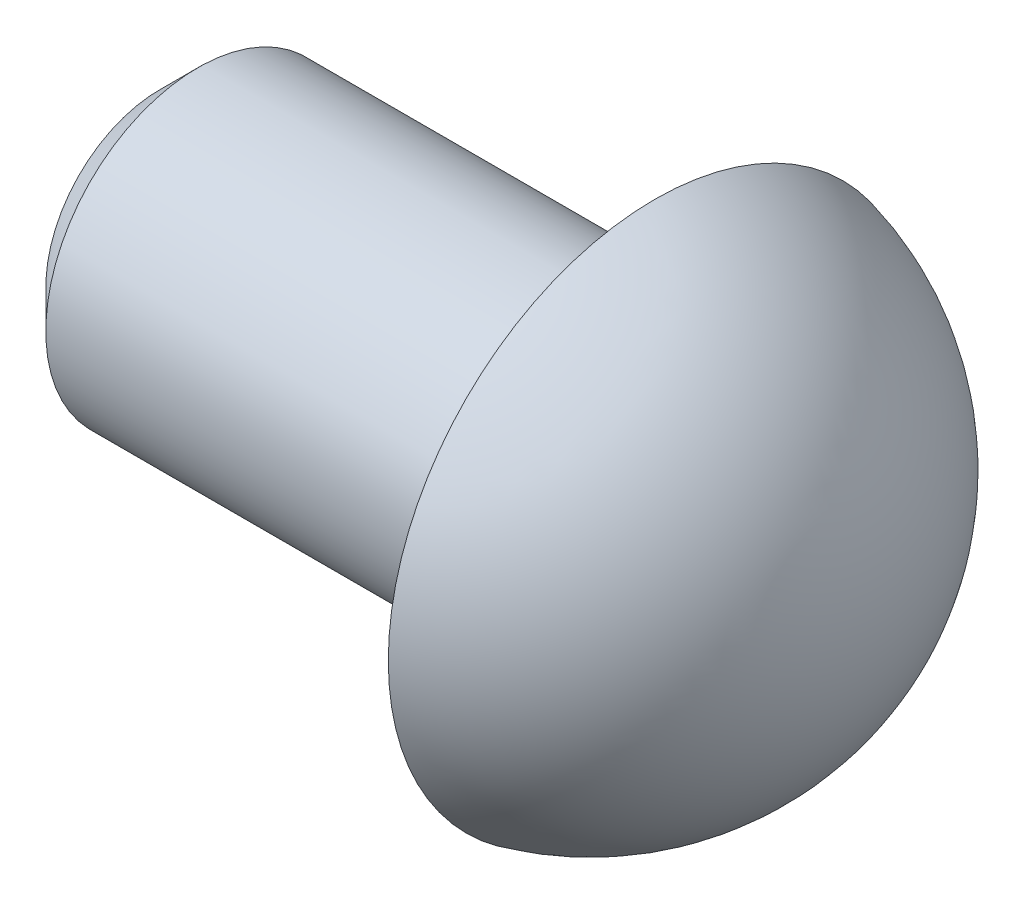
ISO-10303-21;
HEADER;
FILE_DESCRIPTION(('STEP AP214'),'2;1');
FILE_NAME('part.step','',(''),(''),'','','');
FILE_SCHEMA(('AUTOMOTIVE_DESIGN { 1 0 10303 214 1 1 1 1 }'));
ENDSEC;
DATA;
#1=APPLICATION_CONTEXT('core data for automotive mechanical design processes');
#2=APPLICATION_PROTOCOL_DEFINITION('international standard','automotive_design',2000,#1);
#3=PRODUCT_CONTEXT('',#1,'mechanical');
#4=PRODUCT('Part','Part','',(#3));
#5=PRODUCT_RELATED_PRODUCT_CATEGORY('part','',(#4));
#6=PRODUCT_DEFINITION_FORMATION('','',#4);
#7=PRODUCT_DEFINITION_CONTEXT('part definition',#1,'design');
#8=PRODUCT_DEFINITION('design','',#6,#7);
#9=PRODUCT_DEFINITION_SHAPE('','',#8);
#10=(LENGTH_UNIT() NAMED_UNIT(*) SI_UNIT(.MILLI.,.METRE.));
#11=(NAMED_UNIT(*) PLANE_ANGLE_UNIT() SI_UNIT($,.RADIAN.));
#12=(NAMED_UNIT(*) SI_UNIT($,.STERADIAN.) SOLID_ANGLE_UNIT());
#13=UNCERTAINTY_MEASURE_WITH_UNIT(LENGTH_MEASURE(1.E-05),#10,'distance_accuracy_value','');
#14=(GEOMETRIC_REPRESENTATION_CONTEXT(3) GLOBAL_UNCERTAINTY_ASSIGNED_CONTEXT((#13)) GLOBAL_UNIT_ASSIGNED_CONTEXT((#10,
#11,#12)) REPRESENTATION_CONTEXT('',''));
#15=CARTESIAN_POINT('',(0.,0.,0.));
#16=DIRECTION('',(0.,0.,1.));
#17=DIRECTION('',(1.,0.,0.));
#18=AXIS2_PLACEMENT_3D('',#15,#16,#17);
#19=CARTESIAN_POINT('',(-6.5,0.,0.));
#20=DIRECTION('',(1.,0.,0.));
#21=DIRECTION('',(0.,0.,-1.));
#22=AXIS2_PLACEMENT_3D('',#19,#20,#21);
#23=CYLINDRICAL_SURFACE('',#22,2.);
#24=CARTESIAN_POINT('',(-6.,0.,0.));
#25=DIRECTION('',(1.,0.,0.));
#26=DIRECTION('',(0.,0.,-1.));
#27=AXIS2_PLACEMENT_3D('',#24,#25,#26);
#28=CIRCLE('',#27,2.);
#29=CARTESIAN_POINT('',(-6.,0.,-2.));
#30=VERTEX_POINT('',#29);
#31=EDGE_CURVE('E45',#30,#30,#28,.T.);
#32=ORIENTED_EDGE('',*,*,#31,.T.);
#33=EDGE_LOOP('',(#32));
#34=FACE_BOUND('',#33,.T.);
#35=CARTESIAN_POINT('',(0.,0.,0.));
#36=DIRECTION('',(1.,0.,0.));
#37=DIRECTION('',(0.,0.,-1.));
#38=AXIS2_PLACEMENT_3D('',#35,#36,#37);
#39=CIRCLE('',#38,2.);
#40=CARTESIAN_POINT('',(0.,0.,-2.));
#41=VERTEX_POINT('',#40);
#42=EDGE_CURVE('E50',#41,#41,#39,.T.);
#43=ORIENTED_EDGE('',*,*,#42,.F.);
#44=EDGE_LOOP('',(#43));
#45=FACE_BOUND('',#44,.T.);
#46=ADVANCED_FACE('F37',(#34,#45),#23,.T.);
#47=CARTESIAN_POINT('',(-6.5,0.,0.));
#48=DIRECTION('',(1.,0.,0.));
#49=DIRECTION('',(0.,0.,-1.));
#50=AXIS2_PLACEMENT_3D('',#47,#48,#49);
#51=PLANE('',#50);
#52=CARTESIAN_POINT('',(-6.5,0.,0.));
#53=DIRECTION('',(1.,0.,0.));
#54=DIRECTION('',(0.,0.,-1.));
#55=AXIS2_PLACEMENT_3D('',#52,#53,#54);
#56=CIRCLE('',#55,1.49999999999999);
#57=CARTESIAN_POINT('',(-6.5,0.,-1.49999999999999));
#58=VERTEX_POINT('',#57);
#59=EDGE_CURVE('E10',#58,#58,#56,.F.);
#60=ORIENTED_EDGE('',*,*,#59,.T.);
#61=EDGE_LOOP('',(#60));
#62=FACE_BOUND('',#61,.T.);
#63=ADVANCED_FACE('F66',(#62),#51,.F.);
#64=CARTESIAN_POINT('',(-0.842614977317635,0.,0.));
#65=DIRECTION('',(-1.,0.,0.));
#66=DIRECTION('',(0.,0.,-1.));
#67=AXIS2_PLACEMENT_3D('',#64,#65,#66);
#68=SPHERICAL_SURFACE('',#67,3.6);
#69=CARTESIAN_POINT('',(0.,0.,0.));
#70=DIRECTION('',(-1.,0.,0.));
#71=DIRECTION('',(0.,0.,1.));
#72=AXIS2_PLACEMENT_3D('',#69,#70,#71);
#73=CIRCLE('',#72,3.5);
#74=CARTESIAN_POINT('',(0.,0.,3.5));
#75=VERTEX_POINT('',#74);
#76=EDGE_CURVE('E55',#75,#75,#73,.T.);
#77=ORIENTED_EDGE('',*,*,#76,.F.);
#78=EDGE_LOOP('',(#77));
#79=FACE_BOUND('',#78,.T.);
#80=ADVANCED_FACE('F64',(#79),#68,.T.);
#81=CARTESIAN_POINT('',(0.,0.,0.));
#82=DIRECTION('',(1.,0.,0.));
#83=DIRECTION('',(0.,0.,-1.));
#84=AXIS2_PLACEMENT_3D('',#81,#82,#83);
#85=PLANE('',#84);
#86=ORIENTED_EDGE('',*,*,#42,.T.);
#87=EDGE_LOOP('',(#86));
#88=FACE_BOUND('',#87,.T.);
#89=ORIENTED_EDGE('',*,*,#76,.T.);
#90=EDGE_LOOP('',(#89));
#91=FACE_BOUND('',#90,.T.);
#92=ADVANCED_FACE('F62',(#88,#91),#85,.F.);
#93=CARTESIAN_POINT('',(-6.,0.,0.));
#94=DIRECTION('',(1.,0.,0.));
#95=DIRECTION('',(0.,0.,-1.));
#96=AXIS2_PLACEMENT_3D('',#93,#94,#95);
#97=CONICAL_SURFACE('',#96,2.,0.78539816339745);
#98=ORIENTED_EDGE('',*,*,#59,.F.);
#99=EDGE_LOOP('',(#98));
#100=FACE_BOUND('',#99,.T.);
#101=ORIENTED_EDGE('',*,*,#31,.F.);
#102=EDGE_LOOP('',(#101));
#103=FACE_BOUND('',#102,.T.);
#104=ADVANCED_FACE('F39',(#100,#103),#97,.T.);
#105=CLOSED_SHELL('',(#46,#63,#80,#92,#104));
#106=MANIFOLD_SOLID_BREP('B2',#105);
#107=ADVANCED_BREP_SHAPE_REPRESENTATION('',(#18,#106),#14);
#108=SHAPE_DEFINITION_REPRESENTATION(#9,#107);
ENDSEC;
END-ISO-10303-21;
